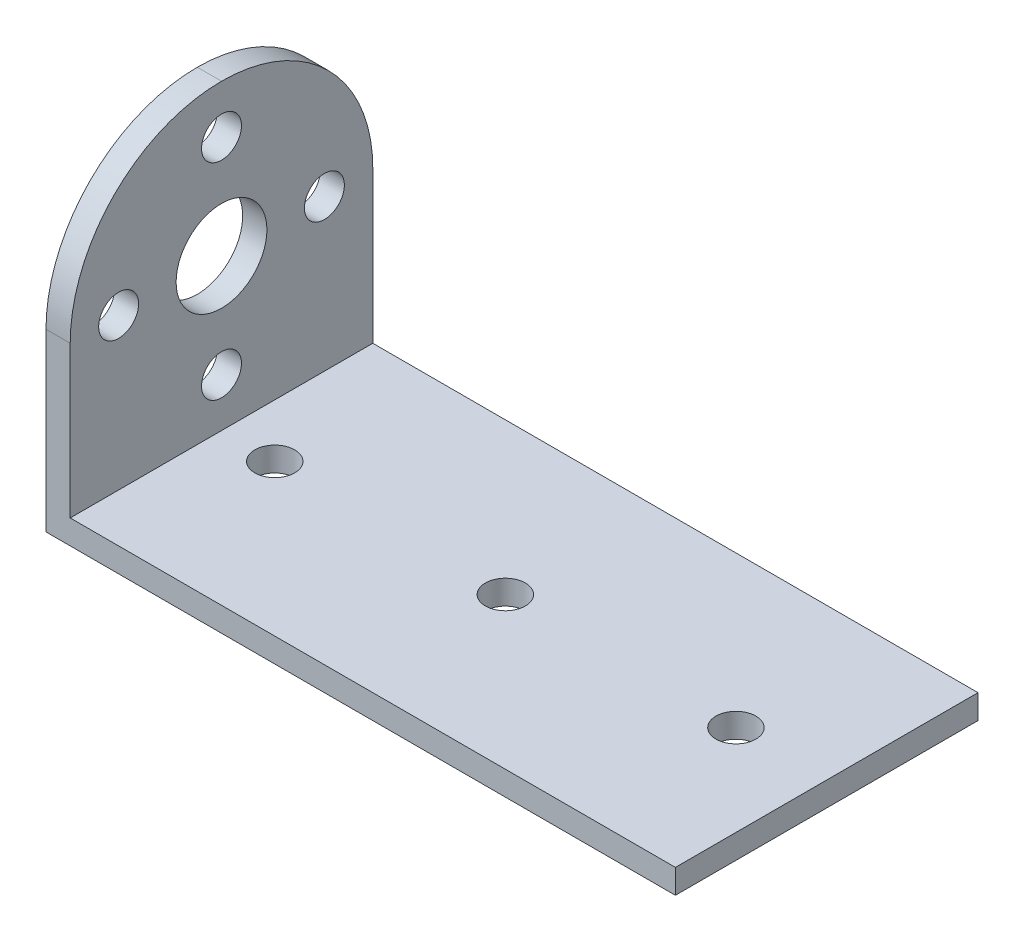
ISO-10303-21;
HEADER;
FILE_DESCRIPTION(('STEP AP214'),'2;1');
FILE_NAME('part.step','',(''),(''),'','','');
FILE_SCHEMA(('AUTOMOTIVE_DESIGN { 1 0 10303 214 1 1 1 1 }'));
ENDSEC;
DATA;
#1=APPLICATION_CONTEXT('core data for automotive mechanical design processes');
#2=APPLICATION_PROTOCOL_DEFINITION('international standard','automotive_design',2000,#1);
#3=PRODUCT_CONTEXT('',#1,'mechanical');
#4=PRODUCT('Part','Part','',(#3));
#5=PRODUCT_RELATED_PRODUCT_CATEGORY('part','',(#4));
#6=PRODUCT_DEFINITION_FORMATION('','',#4);
#7=PRODUCT_DEFINITION_CONTEXT('part definition',#1,'design');
#8=PRODUCT_DEFINITION('design','',#6,#7);
#9=PRODUCT_DEFINITION_SHAPE('','',#8);
#10=(LENGTH_UNIT() NAMED_UNIT(*) SI_UNIT(.MILLI.,.METRE.));
#11=(NAMED_UNIT(*) PLANE_ANGLE_UNIT() SI_UNIT($,.RADIAN.));
#12=(NAMED_UNIT(*) SI_UNIT($,.STERADIAN.) SOLID_ANGLE_UNIT());
#13=UNCERTAINTY_MEASURE_WITH_UNIT(LENGTH_MEASURE(1.E-05),#10,'distance_accuracy_value','');
#14=(GEOMETRIC_REPRESENTATION_CONTEXT(3) GLOBAL_UNCERTAINTY_ASSIGNED_CONTEXT((#13)) GLOBAL_UNIT_ASSIGNED_CONTEXT((#10,
#11,#12)) REPRESENTATION_CONTEXT('',''));
#15=CARTESIAN_POINT('',(0.,0.,0.));
#16=DIRECTION('',(0.,0.,1.));
#17=DIRECTION('',(1.,0.,0.));
#18=AXIS2_PLACEMENT_3D('',#15,#16,#17);
#19=CARTESIAN_POINT('',(52.,0.,25.));
#20=DIRECTION('',(0.,1.,0.));
#21=DIRECTION('',(-1.,0.,0.));
#22=AXIS2_PLACEMENT_3D('',#19,#20,#21);
#23=PLANE('',#22);
#24=CARTESIAN_POINT('',(44.5,0.,12.5));
#25=DIRECTION('',(0.,-1.,0.));
#26=DIRECTION('',(1.,0.,0.));
#27=AXIS2_PLACEMENT_3D('',#24,#25,#26);
#28=CIRCLE('',#27,1.65);
#29=CARTESIAN_POINT('',(46.15,0.,12.5));
#30=VERTEX_POINT('',#29);
#31=EDGE_CURVE('E148',#30,#30,#28,.T.);
#32=ORIENTED_EDGE('',*,*,#31,.F.);
#33=EDGE_LOOP('',(#32));
#34=FACE_BOUND('',#33,.T.);
#35=CARTESIAN_POINT('',(25.45,0.,12.5));
#36=DIRECTION('',(0.,-1.,0.));
#37=DIRECTION('',(1.,0.,0.));
#38=AXIS2_PLACEMENT_3D('',#35,#36,#37);
#39=CIRCLE('',#38,1.65);
#40=CARTESIAN_POINT('',(27.1,0.,12.5));
#41=VERTEX_POINT('',#40);
#42=EDGE_CURVE('E138',#41,#41,#39,.T.);
#43=ORIENTED_EDGE('',*,*,#42,.F.);
#44=EDGE_LOOP('',(#43));
#45=FACE_BOUND('',#44,.T.);
#46=CARTESIAN_POINT('',(6.4,0.,12.5));
#47=DIRECTION('',(0.,-1.,0.));
#48=DIRECTION('',(1.,0.,0.));
#49=AXIS2_PLACEMENT_3D('',#46,#47,#48);
#50=CIRCLE('',#49,1.65);
#51=CARTESIAN_POINT('',(8.05,0.,12.5));
#52=VERTEX_POINT('',#51);
#53=EDGE_CURVE('E135',#52,#52,#50,.T.);
#54=ORIENTED_EDGE('',*,*,#53,.F.);
#55=EDGE_LOOP('',(#54));
#56=FACE_BOUND('',#55,.T.);
#57=DIRECTION('',(1.,0.,0.));
#58=VECTOR('',#57,1.);
#59=CARTESIAN_POINT('',(52.,0.,0.));
#60=LINE('',#59,#58);
#61=CARTESIAN_POINT('',(0.,0.,0.));
#62=VERTEX_POINT('',#61);
#63=CARTESIAN_POINT('',(52.,0.,0.));
#64=VERTEX_POINT('',#63);
#65=EDGE_CURVE('E114',#62,#64,#60,.T.);
#66=ORIENTED_EDGE('',*,*,#65,.T.);
#67=DIRECTION('',(0.,0.,-1.));
#68=VECTOR('',#67,1.);
#69=CARTESIAN_POINT('',(52.,0.,25.));
#70=LINE('',#69,#68);
#71=CARTESIAN_POINT('',(52.,0.,25.));
#72=VERTEX_POINT('',#71);
#73=EDGE_CURVE('E95',#72,#64,#70,.T.);
#74=ORIENTED_EDGE('',*,*,#73,.F.);
#75=DIRECTION('',(1.,0.,0.));
#76=VECTOR('',#75,1.);
#77=CARTESIAN_POINT('',(52.,0.,25.));
#78=LINE('',#77,#76);
#79=CARTESIAN_POINT('',(0.,0.,25.));
#80=VERTEX_POINT('',#79);
#81=EDGE_CURVE('E102',#80,#72,#78,.T.);
#82=ORIENTED_EDGE('',*,*,#81,.F.);
#83=DIRECTION('',(0.,0.,-1.));
#84=VECTOR('',#83,1.);
#85=CARTESIAN_POINT('',(0.,0.,25.));
#86=LINE('',#85,#84);
#87=EDGE_CURVE('E184',#80,#62,#86,.T.);
#88=ORIENTED_EDGE('',*,*,#87,.T.);
#89=EDGE_LOOP('',(#66,#74,#82,#88));
#90=FACE_BOUND('',#89,.T.);
#91=ADVANCED_FACE('F33',(#34,#45,#56,#90),#23,.F.);
#92=CARTESIAN_POINT('',(52.,2.,25.));
#93=DIRECTION('',(-1.,0.,0.));
#94=DIRECTION('',(0.,0.,1.));
#95=AXIS2_PLACEMENT_3D('',#92,#93,#94);
#96=PLANE('',#95);
#97=DIRECTION('',(0.,1.,0.));
#98=VECTOR('',#97,1.);
#99=CARTESIAN_POINT('',(52.,2.,0.));
#100=LINE('',#99,#98);
#101=CARTESIAN_POINT('',(52.,2.,0.));
#102=VERTEX_POINT('',#101);
#103=EDGE_CURVE('E186',#64,#102,#100,.T.);
#104=ORIENTED_EDGE('',*,*,#103,.T.);
#105=DIRECTION('',(0.,0.,-1.));
#106=VECTOR('',#105,1.);
#107=CARTESIAN_POINT('',(52.,2.,25.));
#108=LINE('',#107,#106);
#109=CARTESIAN_POINT('',(52.,2.,25.));
#110=VERTEX_POINT('',#109);
#111=EDGE_CURVE('E98',#110,#102,#108,.T.);
#112=ORIENTED_EDGE('',*,*,#111,.F.);
#113=DIRECTION('',(0.,1.,0.));
#114=VECTOR('',#113,1.);
#115=CARTESIAN_POINT('',(52.,2.,25.));
#116=LINE('',#115,#114);
#117=EDGE_CURVE('E91',#72,#110,#116,.T.);
#118=ORIENTED_EDGE('',*,*,#117,.F.);
#119=ORIENTED_EDGE('',*,*,#73,.T.);
#120=EDGE_LOOP('',(#104,#112,#118,#119));
#121=FACE_BOUND('',#120,.T.);
#122=ADVANCED_FACE('F93',(#121),#96,.F.);
#123=CARTESIAN_POINT('',(2.,2.,25.));
#124=DIRECTION('',(0.,-1.,0.));
#125=DIRECTION('',(0.,0.,-1.));
#126=AXIS2_PLACEMENT_3D('',#123,#124,#125);
#127=PLANE('',#126);
#128=CARTESIAN_POINT('',(44.5,2.,12.5));
#129=DIRECTION('',(0.,-1.,0.));
#130=DIRECTION('',(0.,0.,-1.));
#131=AXIS2_PLACEMENT_3D('',#128,#129,#130);
#132=CIRCLE('',#131,1.65);
#133=CARTESIAN_POINT('',(44.5,2.,10.85));
#134=VERTEX_POINT('',#133);
#135=EDGE_CURVE('E37',#134,#134,#132,.T.);
#136=ORIENTED_EDGE('',*,*,#135,.T.);
#137=EDGE_LOOP('',(#136));
#138=FACE_BOUND('',#137,.T.);
#139=CARTESIAN_POINT('',(25.45,2.,12.5));
#140=DIRECTION('',(0.,-1.,0.));
#141=DIRECTION('',(0.,0.,-1.));
#142=AXIS2_PLACEMENT_3D('',#139,#140,#141);
#143=CIRCLE('',#142,1.65);
#144=CARTESIAN_POINT('',(25.45,2.,10.85));
#145=VERTEX_POINT('',#144);
#146=EDGE_CURVE('E136',#145,#145,#143,.T.);
#147=ORIENTED_EDGE('',*,*,#146,.T.);
#148=EDGE_LOOP('',(#147));
#149=FACE_BOUND('',#148,.T.);
#150=CARTESIAN_POINT('',(6.4,2.,12.5));
#151=DIRECTION('',(0.,-1.,0.));
#152=DIRECTION('',(0.,0.,-1.));
#153=AXIS2_PLACEMENT_3D('',#150,#151,#152);
#154=CIRCLE('',#153,1.65);
#155=CARTESIAN_POINT('',(6.4,2.,10.85));
#156=VERTEX_POINT('',#155);
#157=EDGE_CURVE('E133',#156,#156,#154,.T.);
#158=ORIENTED_EDGE('',*,*,#157,.T.);
#159=EDGE_LOOP('',(#158));
#160=FACE_BOUND('',#159,.T.);
#161=DIRECTION('',(-1.,0.,0.));
#162=VECTOR('',#161,1.);
#163=CARTESIAN_POINT('',(2.,2.,0.));
#164=LINE('',#163,#162);
#165=CARTESIAN_POINT('',(2.,2.,0.));
#166=VERTEX_POINT('',#165);
#167=EDGE_CURVE('E188',#102,#166,#164,.T.);
#168=ORIENTED_EDGE('',*,*,#167,.T.);
#169=DIRECTION('',(0.,0.,-1.));
#170=VECTOR('',#169,1.);
#171=CARTESIAN_POINT('',(2.,2.,25.));
#172=LINE('',#171,#170);
#173=CARTESIAN_POINT('',(2.,2.,25.));
#174=VERTEX_POINT('',#173);
#175=EDGE_CURVE('E119',#174,#166,#172,.T.);
#176=ORIENTED_EDGE('',*,*,#175,.F.);
#177=DIRECTION('',(-1.,0.,0.));
#178=VECTOR('',#177,1.);
#179=CARTESIAN_POINT('',(2.,2.,25.));
#180=LINE('',#179,#178);
#181=EDGE_CURVE('E101',#110,#174,#180,.T.);
#182=ORIENTED_EDGE('',*,*,#181,.F.);
#183=ORIENTED_EDGE('',*,*,#111,.T.);
#184=EDGE_LOOP('',(#168,#176,#182,#183));
#185=FACE_BOUND('',#184,.T.);
#186=ADVANCED_FACE('F212',(#138,#149,#160,#185),#127,.F.);
#187=CARTESIAN_POINT('',(2.,27.,25.));
#188=DIRECTION('',(-1.,0.,0.));
#189=DIRECTION('',(0.,-1.,0.));
#190=AXIS2_PLACEMENT_3D('',#187,#188,#189);
#191=PLANE('',#190);
#192=CARTESIAN_POINT('',(2.00000000000001,6.,12.5));
#193=DIRECTION('',(-1.,0.,0.));
#194=DIRECTION('',(0.,-1.,0.));
#195=AXIS2_PLACEMENT_3D('',#192,#193,#194);
#196=CIRCLE('',#195,1.65);
#197=CARTESIAN_POINT('',(2.00000000000001,4.35,12.5));
#198=VERTEX_POINT('',#197);
#199=EDGE_CURVE('E153',#198,#198,#196,.T.);
#200=ORIENTED_EDGE('',*,*,#199,.T.);
#201=EDGE_LOOP('',(#200));
#202=FACE_BOUND('',#201,.T.);
#203=CARTESIAN_POINT('',(2.,14.5,4.));
#204=DIRECTION('',(-1.,0.,0.));
#205=DIRECTION('',(0.,-1.,0.));
#206=AXIS2_PLACEMENT_3D('',#203,#204,#205);
#207=CIRCLE('',#206,1.65);
#208=CARTESIAN_POINT('',(2.,12.85,4.));
#209=VERTEX_POINT('',#208);
#210=EDGE_CURVE('E159',#209,#209,#207,.T.);
#211=ORIENTED_EDGE('',*,*,#210,.T.);
#212=EDGE_LOOP('',(#211));
#213=FACE_BOUND('',#212,.T.);
#214=CARTESIAN_POINT('',(2.,14.5,21.));
#215=DIRECTION('',(-1.,0.,0.));
#216=DIRECTION('',(0.,-1.,0.));
#217=AXIS2_PLACEMENT_3D('',#214,#215,#216);
#218=CIRCLE('',#217,1.65);
#219=CARTESIAN_POINT('',(2.,12.85,21.));
#220=VERTEX_POINT('',#219);
#221=EDGE_CURVE('E165',#220,#220,#218,.T.);
#222=ORIENTED_EDGE('',*,*,#221,.T.);
#223=EDGE_LOOP('',(#222));
#224=FACE_BOUND('',#223,.T.);
#225=CARTESIAN_POINT('',(2.,23.,12.5));
#226=DIRECTION('',(-1.,0.,0.));
#227=DIRECTION('',(0.,-1.,0.));
#228=AXIS2_PLACEMENT_3D('',#225,#226,#227);
#229=CIRCLE('',#228,1.65);
#230=CARTESIAN_POINT('',(2.,21.35,12.5));
#231=VERTEX_POINT('',#230);
#232=EDGE_CURVE('E171',#231,#231,#229,.T.);
#233=ORIENTED_EDGE('',*,*,#232,.T.);
#234=EDGE_LOOP('',(#233));
#235=FACE_BOUND('',#234,.T.);
#236=CARTESIAN_POINT('',(2.,14.5,12.5));
#237=DIRECTION('',(-1.,0.,0.));
#238=DIRECTION('',(0.,-1.,0.));
#239=AXIS2_PLACEMENT_3D('',#236,#237,#238);
#240=CIRCLE('',#239,3.75);
#241=CARTESIAN_POINT('',(2.,10.75,12.5));
#242=VERTEX_POINT('',#241);
#243=EDGE_CURVE('E177',#242,#242,#240,.T.);
#244=ORIENTED_EDGE('',*,*,#243,.T.);
#245=EDGE_LOOP('',(#244));
#246=FACE_BOUND('',#245,.T.);
#247=DIRECTION('',(0.,1.,0.));
#248=VECTOR('',#247,1.);
#249=CARTESIAN_POINT('',(2.,27.,0.));
#250=LINE('',#249,#248);
#251=CARTESIAN_POINT('',(2.,14.5,0.));
#252=VERTEX_POINT('',#251);
#253=EDGE_CURVE('E190',#166,#252,#250,.T.);
#254=ORIENTED_EDGE('',*,*,#253,.T.);
#255=CARTESIAN_POINT('',(2.,14.5,12.5));
#256=DIRECTION('',(-1.,0.,0.));
#257=DIRECTION('',(0.,-1.,0.));
#258=AXIS2_PLACEMENT_3D('',#255,#256,#257);
#259=CIRCLE('',#258,12.5);
#260=CARTESIAN_POINT('',(2.,27.,12.5));
#261=VERTEX_POINT('',#260);
#262=EDGE_CURVE('E42',#252,#261,#259,.F.);
#263=ORIENTED_EDGE('',*,*,#262,.T.);
#264=CARTESIAN_POINT('',(2.,14.5,12.5));
#265=DIRECTION('',(-1.,0.,0.));
#266=DIRECTION('',(0.,-1.,0.));
#267=AXIS2_PLACEMENT_3D('',#264,#265,#266);
#268=CIRCLE('',#267,12.5);
#269=CARTESIAN_POINT('',(2.,14.5,25.));
#270=VERTEX_POINT('',#269);
#271=EDGE_CURVE('E50',#261,#270,#268,.F.);
#272=ORIENTED_EDGE('',*,*,#271,.T.);
#273=DIRECTION('',(0.,1.,0.));
#274=VECTOR('',#273,1.);
#275=CARTESIAN_POINT('',(2.,27.,25.));
#276=LINE('',#275,#274);
#277=EDGE_CURVE('E181',#174,#270,#276,.T.);
#278=ORIENTED_EDGE('',*,*,#277,.F.);
#279=ORIENTED_EDGE('',*,*,#175,.T.);
#280=EDGE_LOOP('',(#254,#263,#272,#278,#279));
#281=FACE_BOUND('',#280,.T.);
#282=ADVANCED_FACE('F196',(#202,#213,#224,#235,#246,#281),#191,.F.);
#283=CARTESIAN_POINT('',(0.,0.,25.));
#284=DIRECTION('',(1.,0.,0.));
#285=DIRECTION('',(0.,0.,-1.));
#286=AXIS2_PLACEMENT_3D('',#283,#284,#285);
#287=PLANE('',#286);
#288=CARTESIAN_POINT('',(0.,6.,12.5));
#289=DIRECTION('',(-1.,0.,0.));
#290=DIRECTION('',(0.,0.,1.));
#291=AXIS2_PLACEMENT_3D('',#288,#289,#290);
#292=CIRCLE('',#291,1.65);
#293=CARTESIAN_POINT('',(0.,6.,14.15));
#294=VERTEX_POINT('',#293);
#295=EDGE_CURVE('E132',#294,#294,#292,.T.);
#296=ORIENTED_EDGE('',*,*,#295,.F.);
#297=EDGE_LOOP('',(#296));
#298=FACE_BOUND('',#297,.T.);
#299=CARTESIAN_POINT('',(0.,14.5,4.));
#300=DIRECTION('',(-1.,0.,0.));
#301=DIRECTION('',(0.,0.,1.));
#302=AXIS2_PLACEMENT_3D('',#299,#300,#301);
#303=CIRCLE('',#302,1.65);
#304=CARTESIAN_POINT('',(0.,14.5,5.65));
#305=VERTEX_POINT('',#304);
#306=EDGE_CURVE('E156',#305,#305,#303,.T.);
#307=ORIENTED_EDGE('',*,*,#306,.F.);
#308=EDGE_LOOP('',(#307));
#309=FACE_BOUND('',#308,.T.);
#310=CARTESIAN_POINT('',(0.,14.5,21.));
#311=DIRECTION('',(-1.,0.,0.));
#312=DIRECTION('',(0.,0.,1.));
#313=AXIS2_PLACEMENT_3D('',#310,#311,#312);
#314=CIRCLE('',#313,1.65);
#315=CARTESIAN_POINT('',(0.,14.5,22.65));
#316=VERTEX_POINT('',#315);
#317=EDGE_CURVE('E162',#316,#316,#314,.T.);
#318=ORIENTED_EDGE('',*,*,#317,.F.);
#319=EDGE_LOOP('',(#318));
#320=FACE_BOUND('',#319,.T.);
#321=CARTESIAN_POINT('',(0.,23.,12.5));
#322=DIRECTION('',(-1.,0.,0.));
#323=DIRECTION('',(0.,0.,1.));
#324=AXIS2_PLACEMENT_3D('',#321,#322,#323);
#325=CIRCLE('',#324,1.65);
#326=CARTESIAN_POINT('',(0.,23.,14.15));
#327=VERTEX_POINT('',#326);
#328=EDGE_CURVE('E168',#327,#327,#325,.T.);
#329=ORIENTED_EDGE('',*,*,#328,.F.);
#330=EDGE_LOOP('',(#329));
#331=FACE_BOUND('',#330,.T.);
#332=CARTESIAN_POINT('',(0.,14.5,12.5));
#333=DIRECTION('',(-1.,0.,0.));
#334=DIRECTION('',(0.,0.,1.));
#335=AXIS2_PLACEMENT_3D('',#332,#333,#334);
#336=CIRCLE('',#335,3.75);
#337=CARTESIAN_POINT('',(0.,14.5,16.25));
#338=VERTEX_POINT('',#337);
#339=EDGE_CURVE('E174',#338,#338,#336,.T.);
#340=ORIENTED_EDGE('',*,*,#339,.F.);
#341=EDGE_LOOP('',(#340));
#342=FACE_BOUND('',#341,.T.);
#343=CARTESIAN_POINT('',(0.,14.5,12.5));
#344=DIRECTION('',(1.,0.,0.));
#345=DIRECTION('',(0.,0.,-1.));
#346=AXIS2_PLACEMENT_3D('',#343,#344,#345);
#347=CIRCLE('',#346,12.5);
#348=CARTESIAN_POINT('',(0.,14.5,25.));
#349=VERTEX_POINT('',#348);
#350=CARTESIAN_POINT('',(0.,27.,12.5));
#351=VERTEX_POINT('',#350);
#352=EDGE_CURVE('E115',#349,#351,#347,.F.);
#353=ORIENTED_EDGE('',*,*,#352,.T.);
#354=CARTESIAN_POINT('',(0.,14.5,12.5));
#355=DIRECTION('',(1.,0.,0.));
#356=DIRECTION('',(0.,0.,-1.));
#357=AXIS2_PLACEMENT_3D('',#354,#355,#356);
#358=CIRCLE('',#357,12.5);
#359=CARTESIAN_POINT('',(0.,14.5,0.));
#360=VERTEX_POINT('',#359);
#361=EDGE_CURVE('E117',#351,#360,#358,.F.);
#362=ORIENTED_EDGE('',*,*,#361,.T.);
#363=DIRECTION('',(0.,-1.,0.));
#364=VECTOR('',#363,1.);
#365=CARTESIAN_POINT('',(0.,0.,0.));
#366=LINE('',#365,#364);
#367=EDGE_CURVE('E111',#360,#62,#366,.T.);
#368=ORIENTED_EDGE('',*,*,#367,.T.);
#369=ORIENTED_EDGE('',*,*,#87,.F.);
#370=DIRECTION('',(0.,-1.,0.));
#371=VECTOR('',#370,1.);
#372=CARTESIAN_POINT('',(0.,0.,25.));
#373=LINE('',#372,#371);
#374=EDGE_CURVE('E107',#349,#80,#373,.T.);
#375=ORIENTED_EDGE('',*,*,#374,.F.);
#376=EDGE_LOOP('',(#353,#362,#368,#369,#375));
#377=FACE_BOUND('',#376,.T.);
#378=ADVANCED_FACE('F211',(#298,#309,#320,#331,#342,#377),#287,.F.);
#379=CARTESIAN_POINT('',(0.,0.,25.));
#380=DIRECTION('',(0.,0.,-1.));
#381=DIRECTION('',(-1.,0.,0.));
#382=AXIS2_PLACEMENT_3D('',#379,#380,#381);
#383=PLANE('',#382);
#384=ORIENTED_EDGE('',*,*,#277,.T.);
#385=DIRECTION('',(-1.,0.,0.));
#386=VECTOR('',#385,1.);
#387=CARTESIAN_POINT('',(0.,14.5,25.));
#388=LINE('',#387,#386);
#389=EDGE_CURVE('E11',#270,#349,#388,.T.);
#390=ORIENTED_EDGE('',*,*,#389,.T.);
#391=ORIENTED_EDGE('',*,*,#374,.T.);
#392=ORIENTED_EDGE('',*,*,#81,.T.);
#393=ORIENTED_EDGE('',*,*,#117,.T.);
#394=ORIENTED_EDGE('',*,*,#181,.T.);
#395=EDGE_LOOP('',(#384,#390,#391,#392,#393,#394));
#396=FACE_BOUND('',#395,.T.);
#397=ADVANCED_FACE('F105',(#396),#383,.F.);
#398=CARTESIAN_POINT('',(0.,0.,0.));
#399=DIRECTION('',(0.,0.,-1.));
#400=DIRECTION('',(-1.,0.,0.));
#401=AXIS2_PLACEMENT_3D('',#398,#399,#400);
#402=PLANE('',#401);
#403=ORIENTED_EDGE('',*,*,#367,.F.);
#404=DIRECTION('',(-1.,0.,0.));
#405=VECTOR('',#404,1.);
#406=CARTESIAN_POINT('',(2.,14.5,0.));
#407=LINE('',#406,#405);
#408=EDGE_CURVE('E124',#360,#252,#407,.F.);
#409=ORIENTED_EDGE('',*,*,#408,.T.);
#410=ORIENTED_EDGE('',*,*,#253,.F.);
#411=ORIENTED_EDGE('',*,*,#167,.F.);
#412=ORIENTED_EDGE('',*,*,#103,.F.);
#413=ORIENTED_EDGE('',*,*,#65,.F.);
#414=EDGE_LOOP('',(#403,#409,#410,#411,#412,#413));
#415=FACE_BOUND('',#414,.T.);
#416=ADVANCED_FACE('F201',(#415),#402,.T.);
#417=CARTESIAN_POINT('',(25.,14.5,12.5));
#418=DIRECTION('',(-1.,0.,0.));
#419=DIRECTION('',(0.,0.,1.));
#420=AXIS2_PLACEMENT_3D('',#417,#418,#419);
#421=CYLINDRICAL_SURFACE('',#420,3.75);
#422=ORIENTED_EDGE('',*,*,#339,.T.);
#423=EDGE_LOOP('',(#422));
#424=FACE_BOUND('',#423,.T.);
#425=ORIENTED_EDGE('',*,*,#243,.F.);
#426=EDGE_LOOP('',(#425));
#427=FACE_BOUND('',#426,.T.);
#428=ADVANCED_FACE('F262',(#424,#427),#421,.F.);
#429=CARTESIAN_POINT('',(25.,23.,12.5));
#430=DIRECTION('',(-1.,0.,0.));
#431=DIRECTION('',(0.,0.,1.));
#432=AXIS2_PLACEMENT_3D('',#429,#430,#431);
#433=CYLINDRICAL_SURFACE('',#432,1.65);
#434=ORIENTED_EDGE('',*,*,#328,.T.);
#435=EDGE_LOOP('',(#434));
#436=FACE_BOUND('',#435,.T.);
#437=ORIENTED_EDGE('',*,*,#232,.F.);
#438=EDGE_LOOP('',(#437));
#439=FACE_BOUND('',#438,.T.);
#440=ADVANCED_FACE('F258',(#436,#439),#433,.F.);
#441=CARTESIAN_POINT('',(25.,14.5,21.));
#442=DIRECTION('',(-1.,0.,0.));
#443=DIRECTION('',(0.,0.,1.));
#444=AXIS2_PLACEMENT_3D('',#441,#442,#443);
#445=CYLINDRICAL_SURFACE('',#444,1.65);
#446=ORIENTED_EDGE('',*,*,#317,.T.);
#447=EDGE_LOOP('',(#446));
#448=FACE_BOUND('',#447,.T.);
#449=ORIENTED_EDGE('',*,*,#221,.F.);
#450=EDGE_LOOP('',(#449));
#451=FACE_BOUND('',#450,.T.);
#452=ADVANCED_FACE('F250',(#448,#451),#445,.F.);
#453=CARTESIAN_POINT('',(25.,14.5,4.));
#454=DIRECTION('',(-1.,0.,0.));
#455=DIRECTION('',(0.,0.,1.));
#456=AXIS2_PLACEMENT_3D('',#453,#454,#455);
#457=CYLINDRICAL_SURFACE('',#456,1.65);
#458=ORIENTED_EDGE('',*,*,#306,.T.);
#459=EDGE_LOOP('',(#458));
#460=FACE_BOUND('',#459,.T.);
#461=ORIENTED_EDGE('',*,*,#210,.F.);
#462=EDGE_LOOP('',(#461));
#463=FACE_BOUND('',#462,.T.);
#464=ADVANCED_FACE('F244',(#460,#463),#457,.F.);
#465=CARTESIAN_POINT('',(25.,6.,12.5));
#466=DIRECTION('',(-1.,0.,0.));
#467=DIRECTION('',(0.,0.,1.));
#468=AXIS2_PLACEMENT_3D('',#465,#466,#467);
#469=CYLINDRICAL_SURFACE('',#468,1.65);
#470=ORIENTED_EDGE('',*,*,#295,.T.);
#471=EDGE_LOOP('',(#470));
#472=FACE_BOUND('',#471,.T.);
#473=ORIENTED_EDGE('',*,*,#199,.F.);
#474=EDGE_LOOP('',(#473));
#475=FACE_BOUND('',#474,.T.);
#476=ADVANCED_FACE('F240',(#472,#475),#469,.F.);
#477=CARTESIAN_POINT('',(0.,14.5,12.5));
#478=DIRECTION('',(-1.,0.,0.));
#479=DIRECTION('',(0.,0.,1.));
#480=AXIS2_PLACEMENT_3D('',#477,#478,#479);
#481=CYLINDRICAL_SURFACE('',#480,12.5);
#482=ORIENTED_EDGE('',*,*,#389,.F.);
#483=ORIENTED_EDGE('',*,*,#271,.F.);
#484=DIRECTION('',(-1.,0.,0.));
#485=VECTOR('',#484,1.);
#486=CARTESIAN_POINT('',(0.,27.,12.5));
#487=LINE('',#486,#485);
#488=EDGE_CURVE('E129',#351,#261,#487,.F.);
#489=ORIENTED_EDGE('',*,*,#488,.F.);
#490=ORIENTED_EDGE('',*,*,#352,.F.);
#491=EDGE_LOOP('',(#482,#483,#489,#490));
#492=FACE_BOUND('',#491,.T.);
#493=ADVANCED_FACE('F35',(#492),#481,.T.);
#494=CARTESIAN_POINT('',(0.,14.5,12.5));
#495=DIRECTION('',(1.,0.,0.));
#496=DIRECTION('',(0.,0.,-1.));
#497=AXIS2_PLACEMENT_3D('',#494,#495,#496);
#498=CYLINDRICAL_SURFACE('',#497,12.5);
#499=ORIENTED_EDGE('',*,*,#262,.F.);
#500=ORIENTED_EDGE('',*,*,#408,.F.);
#501=ORIENTED_EDGE('',*,*,#361,.F.);
#502=ORIENTED_EDGE('',*,*,#488,.T.);
#503=EDGE_LOOP('',(#499,#500,#501,#502));
#504=FACE_BOUND('',#503,.T.);
#505=ADVANCED_FACE('F205',(#504),#498,.T.);
#506=CARTESIAN_POINT('',(6.4,10.,12.5));
#507=DIRECTION('',(0.,-1.,0.));
#508=DIRECTION('',(1.,0.,0.));
#509=AXIS2_PLACEMENT_3D('',#506,#507,#508);
#510=CYLINDRICAL_SURFACE('',#509,1.65);
#511=ORIENTED_EDGE('',*,*,#53,.T.);
#512=EDGE_LOOP('',(#511));
#513=FACE_BOUND('',#512,.T.);
#514=ORIENTED_EDGE('',*,*,#157,.F.);
#515=EDGE_LOOP('',(#514));
#516=FACE_BOUND('',#515,.T.);
#517=ADVANCED_FACE('F233',(#513,#516),#510,.F.);
#518=CARTESIAN_POINT('',(25.45,10.,12.5));
#519=DIRECTION('',(0.,-1.,0.));
#520=DIRECTION('',(1.,0.,0.));
#521=AXIS2_PLACEMENT_3D('',#518,#519,#520);
#522=CYLINDRICAL_SURFACE('',#521,1.65);
#523=ORIENTED_EDGE('',*,*,#42,.T.);
#524=EDGE_LOOP('',(#523));
#525=FACE_BOUND('',#524,.T.);
#526=ORIENTED_EDGE('',*,*,#146,.F.);
#527=EDGE_LOOP('',(#526));
#528=FACE_BOUND('',#527,.T.);
#529=ADVANCED_FACE('F237',(#525,#528),#522,.F.);
#530=CARTESIAN_POINT('',(44.5,10.,12.5));
#531=DIRECTION('',(0.,-1.,0.));
#532=DIRECTION('',(1.,0.,0.));
#533=AXIS2_PLACEMENT_3D('',#530,#531,#532);
#534=CYLINDRICAL_SURFACE('',#533,1.65);
#535=ORIENTED_EDGE('',*,*,#31,.T.);
#536=EDGE_LOOP('',(#535));
#537=FACE_BOUND('',#536,.T.);
#538=ORIENTED_EDGE('',*,*,#135,.F.);
#539=EDGE_LOOP('',(#538));
#540=FACE_BOUND('',#539,.T.);
#541=ADVANCED_FACE('F378',(#537,#540),#534,.F.);
#542=CLOSED_SHELL('',(#91,#122,#186,#282,#378,#397,#416,#428,#440,#452,#464,#476,#493,#505,#517,
#529,#541));
#543=MANIFOLD_SOLID_BREP('B2',#542);
#544=ADVANCED_BREP_SHAPE_REPRESENTATION('',(#18,#543),#14);
#545=SHAPE_DEFINITION_REPRESENTATION(#9,#544);
ENDSEC;
END-ISO-10303-21;
